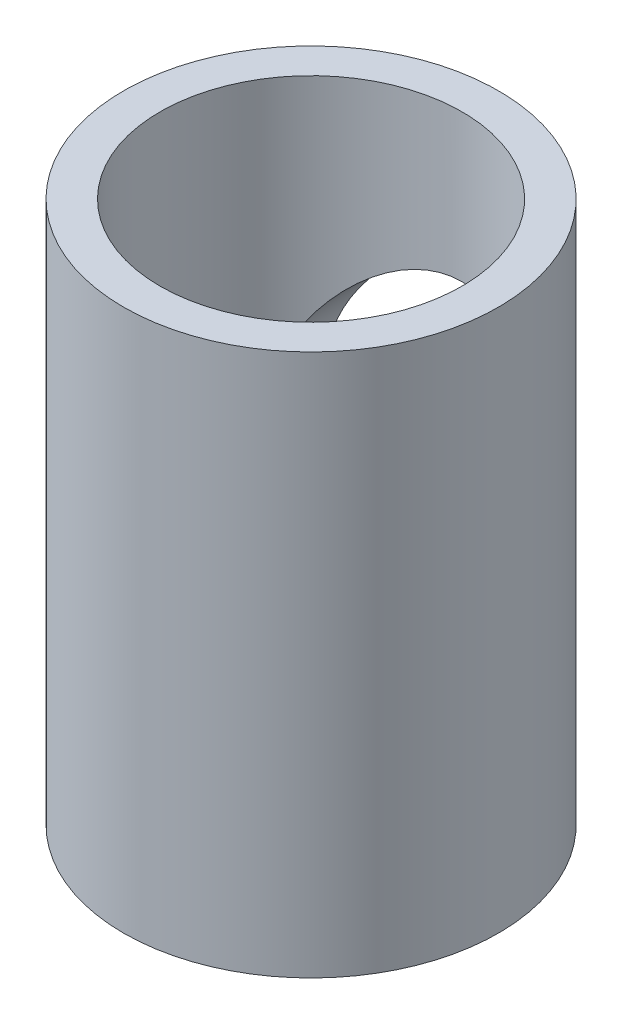
ISO-10303-21;
HEADER;
FILE_DESCRIPTION(('STEP AP214'),'2;1');
FILE_NAME('part.step','',(''),(''),'','','');
FILE_SCHEMA(('AUTOMOTIVE_DESIGN { 1 0 10303 214 1 1 1 1 }'));
ENDSEC;
DATA;
#1=APPLICATION_CONTEXT('core data for automotive mechanical design processes');
#2=APPLICATION_PROTOCOL_DEFINITION('international standard','automotive_design',2000,#1);
#3=PRODUCT_CONTEXT('',#1,'mechanical');
#4=PRODUCT('Part','Part','',(#3));
#5=PRODUCT_RELATED_PRODUCT_CATEGORY('part','',(#4));
#6=PRODUCT_DEFINITION_FORMATION('','',#4);
#7=PRODUCT_DEFINITION_CONTEXT('part definition',#1,'design');
#8=PRODUCT_DEFINITION('design','',#6,#7);
#9=PRODUCT_DEFINITION_SHAPE('','',#8);
#10=(LENGTH_UNIT() NAMED_UNIT(*) SI_UNIT(.MILLI.,.METRE.));
#11=(NAMED_UNIT(*) PLANE_ANGLE_UNIT() SI_UNIT($,.RADIAN.));
#12=(NAMED_UNIT(*) SI_UNIT($,.STERADIAN.) SOLID_ANGLE_UNIT());
#13=UNCERTAINTY_MEASURE_WITH_UNIT(LENGTH_MEASURE(1.E-05),#10,'distance_accuracy_value','');
#14=(GEOMETRIC_REPRESENTATION_CONTEXT(3) GLOBAL_UNCERTAINTY_ASSIGNED_CONTEXT((#13)) GLOBAL_UNIT_ASSIGNED_CONTEXT((#10,
#11,#12)) REPRESENTATION_CONTEXT('',''));
#15=CARTESIAN_POINT('',(0.,0.,0.));
#16=DIRECTION('',(0.,0.,1.));
#17=DIRECTION('',(1.,0.,0.));
#18=AXIS2_PLACEMENT_3D('',#15,#16,#17);
#19=CARTESIAN_POINT('',(0.,8.89,0.));
#20=DIRECTION('',(0.,1.,0.));
#21=DIRECTION('',(0.,0.,1.));
#22=AXIS2_PLACEMENT_3D('',#19,#20,#21);
#23=PLANE('',#22);
#24=CARTESIAN_POINT('',(0.,8.89,0.));
#25=DIRECTION('',(0.,1.,0.));
#26=DIRECTION('',(0.,0.,1.));
#27=AXIS2_PLACEMENT_3D('',#24,#25,#26);
#28=CIRCLE('',#27,3.0734);
#29=CARTESIAN_POINT('',(0.,8.89,3.0734));
#30=VERTEX_POINT('',#29);
#31=EDGE_CURVE('E10',#30,#30,#28,.T.);
#32=ORIENTED_EDGE('',*,*,#31,.T.);
#33=EDGE_LOOP('',(#32));
#34=FACE_BOUND('',#33,.T.);
#35=CARTESIAN_POINT('',(0.,8.89,0.));
#36=DIRECTION('',(0.,1.,0.));
#37=DIRECTION('',(0.,0.,1.));
#38=AXIS2_PLACEMENT_3D('',#35,#36,#37);
#39=CIRCLE('',#38,2.4765);
#40=CARTESIAN_POINT('',(0.,8.89,2.4765));
#41=VERTEX_POINT('',#40);
#42=EDGE_CURVE('E58',#41,#41,#39,.T.);
#43=ORIENTED_EDGE('',*,*,#42,.F.);
#44=EDGE_LOOP('',(#43));
#45=FACE_BOUND('',#44,.T.);
#46=ADVANCED_FACE('F37',(#34,#45),#23,.T.);
#47=CARTESIAN_POINT('',(0.,0.,0.));
#48=DIRECTION('',(0.,1.,0.));
#49=DIRECTION('',(0.,0.,1.));
#50=AXIS2_PLACEMENT_3D('',#47,#48,#49);
#51=PLANE('',#50);
#52=CARTESIAN_POINT('',(0.,0.,0.));
#53=DIRECTION('',(0.,1.,0.));
#54=DIRECTION('',(0.,0.,1.));
#55=AXIS2_PLACEMENT_3D('',#52,#53,#54);
#56=CIRCLE('',#55,3.0734);
#57=CARTESIAN_POINT('',(0.,0.,3.0734));
#58=VERTEX_POINT('',#57);
#59=EDGE_CURVE('E52',#58,#58,#56,.T.);
#60=ORIENTED_EDGE('',*,*,#59,.F.);
#61=EDGE_LOOP('',(#60));
#62=FACE_BOUND('',#61,.T.);
#63=CARTESIAN_POINT('',(0.,0.,0.));
#64=DIRECTION('',(0.,1.,0.));
#65=DIRECTION('',(0.,0.,1.));
#66=AXIS2_PLACEMENT_3D('',#63,#64,#65);
#67=CIRCLE('',#66,2.4765);
#68=CARTESIAN_POINT('',(0.,0.,2.4765));
#69=VERTEX_POINT('',#68);
#70=EDGE_CURVE('E60',#69,#69,#67,.T.);
#71=ORIENTED_EDGE('',*,*,#70,.T.);
#72=EDGE_LOOP('',(#71));
#73=FACE_BOUND('',#72,.T.);
#74=ADVANCED_FACE('F84',(#62,#73),#51,.F.);
#75=CARTESIAN_POINT('',(0.,8.89,0.));
#76=DIRECTION('',(0.,-1.,0.));
#77=DIRECTION('',(0.,0.,-1.));
#78=AXIS2_PLACEMENT_3D('',#75,#76,#77);
#79=CYLINDRICAL_SURFACE('',#78,3.0734);
#80=CARTESIAN_POINT('',(0.,6.477,-3.0734));
#81=CARTESIAN_POINT('',(-0.10225289942617,6.47699877673899,-3.0733987588104));
#82=CARTESIAN_POINT('',(-0.204518236075201,6.46923858992135,-3.06825192706615));
#83=CARTESIAN_POINT('',(-0.405797939531909,6.4386725816748,-3.04817386157803));
#84=CARTESIAN_POINT('',(-0.504810350964647,6.41585787842283,-3.03323685188629));
#85=CARTESIAN_POINT('',(-0.696373019028094,6.35657108321296,-2.99505551441883));
#86=CARTESIAN_POINT('',(-0.788951220287525,6.32016308280394,-2.97185019429626));
#87=CARTESIAN_POINT('',(-0.966319884194982,6.23523175988476,-2.91900488736583));
#88=CARTESIAN_POINT('',(-1.05110930544454,6.18670682049561,-2.88936404187325));
#89=CARTESIAN_POINT('',(-1.21855629463535,6.07446231452068,-2.82306285490962));
#90=CARTESIAN_POINT('',(-1.30043265214491,6.00980713574707,-2.78602154293958));
#91=CARTESIAN_POINT('',(-1.45292180382382,5.86936252834189,-2.70963033193267));
#92=CARTESIAN_POINT('',(-1.52351832435655,5.79355731060153,-2.67027720749387));
#93=CARTESIAN_POINT('',(-1.66260977928514,5.61932683734656,-2.58632522321169));
#94=CARTESIAN_POINT('',(-1.7290887644763,5.51921648518952,-2.5418570302728));
#95=CARTESIAN_POINT('',(-1.84418117486143,5.3067169126017,-2.45963196308266));
#96=CARTESIAN_POINT('',(-1.89282550432759,5.1943493744375,-2.42186353852985));
#97=CARTESIAN_POINT('',(-1.95875596980392,4.99282426563274,-2.36861226015837));
#98=CARTESIAN_POINT('',(-1.98102759644081,4.90617375705891,-2.34984585513984));
#99=CARTESIAN_POINT('',(-2.0140185642247,4.7292806421597,-2.32163746067706));
#100=CARTESIAN_POINT('',(-2.02475732038086,4.63904433881782,-2.31217980267335));
#101=CARTESIAN_POINT('',(-2.0340116458957,4.45708805476412,-2.30404644593821));
#102=CARTESIAN_POINT('',(-2.03247999464929,4.36536369928352,-2.30541239984204));
#103=CARTESIAN_POINT('',(-2.01719383795085,4.18369954603422,-2.31879478320079));
#104=CARTESIAN_POINT('',(-2.00342900083529,4.09376132241583,-2.3308202152057));
#105=CARTESIAN_POINT('',(-1.96536816682816,3.92173464510073,-2.36298439110077));
#106=CARTESIAN_POINT('',(-1.9415264028326,3.83947556513053,-2.38277080773298));
#107=CARTESIAN_POINT('',(-1.88442181144922,3.68004412907284,-2.42818237450375));
#108=CARTESIAN_POINT('',(-1.85115589104458,3.60287345327194,-2.45380944100819));
#109=CARTESIAN_POINT('',(-1.76847363686258,3.43924638979723,-2.51424020045157));
#110=CARTESIAN_POINT('',(-1.71715356744106,3.35405301819891,-2.54985242566109));
#111=CARTESIAN_POINT('',(-1.60313897441854,3.19249792881881,-2.62303919323327));
#112=CARTESIAN_POINT('',(-1.54043049773575,3.11614723513039,-2.66061610205888));
#113=CARTESIAN_POINT('',(-1.39014426962385,2.95813786254016,-2.74263664633532));
#114=CARTESIAN_POINT('',(-1.3001071845104,2.87868809219246,-2.78687960691633));
#115=CARTESIAN_POINT('',(-1.10570353883657,2.73592325309743,-2.86955257749036));
#116=CARTESIAN_POINT('',(-1.00135101158201,2.67259255445939,-2.90798820376402));
#117=CARTESIAN_POINT('',(-0.802165303404652,2.57542845795318,-2.96831941827293));
#118=CARTESIAN_POINT('',(-0.709504957816962,2.53824213346071,-2.99198167182423));
#119=CARTESIAN_POINT('',(-0.51813415434768,2.47761302617988,-3.03097877065912));
#120=CARTESIAN_POINT('',(-0.4194288455978,2.45415872140387,-3.04632059648141));
#121=CARTESIAN_POINT('',(-0.218168492122792,2.4221689249972,-3.06732152475292));
#122=CARTESIAN_POINT('',(-0.115599379268461,2.41369471387031,-3.07294085246829));
#123=CARTESIAN_POINT('',(0.0896873016520361,2.41238789467621,-3.07380453063008));
#124=CARTESIAN_POINT('',(0.192404863734689,2.41955467282581,-3.06904928819504));
#125=CARTESIAN_POINT('',(0.387876226042322,2.44808107634165,-3.05030257094717));
#126=CARTESIAN_POINT('',(0.480838119584853,2.46846414518199,-3.0369470113744));
#127=CARTESIAN_POINT('',(0.661725861047208,2.52145334897767,-3.00272994958632));
#128=CARTESIAN_POINT('',(0.749650898422593,2.55406144488304,-2.98186724321206));
#129=CARTESIAN_POINT('',(0.924226037110275,2.63266059760848,-2.93263342064935));
#130=CARTESIAN_POINT('',(1.01043795708874,2.6793719799755,-2.90386859721382));
#131=CARTESIAN_POINT('',(1.17411688551911,2.78370284484504,-2.84164011803446));
#132=CARTESIAN_POINT('',(1.25157813514077,2.84132944467493,-2.8081734000925));
#133=CARTESIAN_POINT('',(1.408430799629,2.97610195690367,-2.73327598988553));
#134=CARTESIAN_POINT('',(1.48620730110174,3.05489250165295,-2.69142085646646));
#135=CARTESIAN_POINT('',(1.62812494509582,3.22416309652032,-2.60802108601504));
#136=CARTESIAN_POINT('',(1.69225791404109,3.31465010187625,-2.56647664941222));
#137=CARTESIAN_POINT('',(1.80015167325279,3.49706016572785,-2.49181059031919));
#138=CARTESIAN_POINT('',(1.84528515090161,3.58799250333235,-2.45826284586167));
#139=CARTESIAN_POINT('',(1.92201406567958,3.77768707368384,-2.3987534014274));
#140=CARTESIAN_POINT('',(1.95363394272279,3.87643478521648,-2.37277803377778));
#141=CARTESIAN_POINT('',(1.99757490308141,4.06258585187896,-2.33584425333396));
#142=CARTESIAN_POINT('',(2.01226302098541,4.1490637980316,-2.32308360719194));
#143=CARTESIAN_POINT('',(2.0302977893316,4.32404517518141,-2.30734318883211));
#144=CARTESIAN_POINT('',(2.03365556408794,4.41254653353513,-2.30435382310355));
#145=CARTESIAN_POINT('',(2.02881383253913,4.58898105212255,-2.30861622238297));
#146=CARTESIAN_POINT('',(2.02061283367468,4.67691413750338,-2.31586930997692));
#147=CARTESIAN_POINT('',(1.99319658113794,4.84981974407824,-2.33950223156355));
#148=CARTESIAN_POINT('',(1.97396675832368,4.93478819115338,-2.35589413718817));
#149=CARTESIAN_POINT('',(1.91875298710554,5.12285717986865,-2.40120087202976));
#150=CARTESIAN_POINT('',(1.87960955273754,5.22448869378104,-2.43232347057093));
#151=CARTESIAN_POINT('',(1.78689301524272,5.41846738756082,-2.50122587404046));
#152=CARTESIAN_POINT('',(1.73329982784391,5.51080139725334,-2.53901491945611));
#153=CARTESIAN_POINT('',(1.61198706223949,5.68682828690856,-2.61774835566215));
#154=CARTESIAN_POINT('',(1.54403830758173,5.77034323971913,-2.65873614885324));
#155=CARTESIAN_POINT('',(1.39550617835717,5.92593084090089,-2.73961808722974));
#156=CARTESIAN_POINT('',(1.3149191302179,5.99800015006984,-2.7795119104574));
#157=CARTESIAN_POINT('',(1.13076518652201,6.137753791451,-2.85980762818421));
#158=CARTESIAN_POINT('',(1.02557491285099,6.20367287402469,-2.89961107058536));
#159=CARTESIAN_POINT('',(0.802280508517006,6.31607103199848,-2.96912772684367));
#160=CARTESIAN_POINT('',(0.684200318744576,6.36258539870891,-2.99885923981275));
#161=CARTESIAN_POINT('',(0.471377740531871,6.42380422839951,-3.03842882477958));
#162=CARTESIAN_POINT('',(0.378690310217695,6.4436621084466,-3.05144513212511));
#163=CARTESIAN_POINT('',(0.190671163164194,6.47025681845768,-3.06892885767475));
#164=CARTESIAN_POINT('',(0.0953409878984267,6.47700114057317,-3.07340115728985));
#165=CARTESIAN_POINT('',(0.,6.477,-3.0734));
#166=B_SPLINE_CURVE_WITH_KNOTS('',3,(#80,#81,#82,#83,#84,#85,#86,#87,#88,#89,#90,#91,#92,#93,
#94,#95,#96,#97,#98,#99,#100,#101,#102,#103,#104,#105,#106,#107,#108,#109,#110,#111,#112,#113,
#114,#115,#116,#117,#118,#119,#120,#121,#122,#123,#124,#125,#126,#127,#128,#129,#130,#131,#132,
#133,#134,#135,#136,#137,#138,#139,#140,#141,#142,#143,#144,#145,#146,#147,#148,#149,#150,#151,
#152,#153,#154,#155,#156,#157,#158,#159,#160,#161,#162,#163,#164,#165),.UNSPECIFIED.,.T.,.F.,(4,
2,2,2,2,2,2,2,2,2,2,2,2,2,2,2,2,2,2,2,2,2,2,2,2,2,2,2,2,2,2,2,2,2,2,2,2,2,2,2,2,2,4),(0.,
0.306373505804366,0.6129279268288,0.918054850064876,1.22322251108127,1.55409610838465,
1.88544283513527,2.2680670471764,2.650025070639,2.92317324477001,3.19586086335182,
3.46959837714451,3.74356729871388,4.00631955200361,4.26915814092834,4.58496815012121,
4.90116773278214,5.28325304326235,5.66496644023595,5.97150248526908,6.27778095821417,
6.58530947940367,6.89282593278601,7.17987144943446,7.46696302920455,7.77234683746643,
8.07793046271756,8.43160801754241,8.78549686076078,9.10505789912865,9.42403852681178,
9.68879042887973,9.95328231749755,10.217808362507,10.4826846555157,10.8206753611555,
11.159138296867,11.5034795338635,11.8479210466649,12.2367997450483,12.6249680744557,
12.9107952325268,13.1964590413108),.UNSPECIFIED.);
#167=CARTESIAN_POINT('',(0.,6.477,-3.0734));
#168=VERTEX_POINT('',#167);
#169=EDGE_CURVE('E64',#168,#168,#166,.T.);
#170=ORIENTED_EDGE('',*,*,#169,.T.);
#171=EDGE_LOOP('',(#170));
#172=FACE_BOUND('',#171,.T.);
#173=ORIENTED_EDGE('',*,*,#31,.F.);
#174=EDGE_LOOP('',(#173));
#175=FACE_BOUND('',#174,.T.);
#176=ORIENTED_EDGE('',*,*,#59,.T.);
#177=EDGE_LOOP('',(#176));
#178=FACE_BOUND('',#177,.T.);
#179=ADVANCED_FACE('F39',(#172,#175,#178),#79,.T.);
#180=CARTESIAN_POINT('',(0.,8.89,0.));
#181=DIRECTION('',(0.,-1.,0.));
#182=DIRECTION('',(0.,0.,-1.));
#183=AXIS2_PLACEMENT_3D('',#180,#181,#182);
#184=CYLINDRICAL_SURFACE('',#183,2.4765);
#185=CARTESIAN_POINT('',(0.,6.477,-2.4765));
#186=CARTESIAN_POINT('',(-0.0968633235630444,6.47699164919354,-2.47649186598758));
#187=CARTESIAN_POINT('',(-0.193842807933544,6.47001673117817,-2.47076019933378));
#188=CARTESIAN_POINT('',(-0.384648142920058,6.44259987522917,-2.44834107786058));
#189=CARTESIAN_POINT('',(-0.478467797148274,6.42213293143819,-2.43163328029215));
#190=CARTESIAN_POINT('',(-0.659678395164487,6.36924112939771,-2.38882650661548));
#191=CARTESIAN_POINT('',(-0.747106061122676,6.33689229030201,-2.3627872574241));
#192=CARTESIAN_POINT('',(-0.914549749987563,6.26188054834556,-2.3031648394329));
#193=CARTESIAN_POINT('',(-0.994565016895317,6.21921659503307,-2.26958090233564));
#194=CARTESIAN_POINT('',(-1.17380245827522,6.10812481840184,-2.1836542024751));
#195=CARTESIAN_POINT('',(-1.26955644128869,6.03595289202546,-2.12891253598948));
#196=CARTESIAN_POINT('',(-1.44542428948267,5.87811324177596,-2.0136819285567));
#197=CARTESIAN_POINT('',(-1.5254921760427,5.79240713485001,-1.95317684225961));
#198=CARTESIAN_POINT('',(-1.67098788361007,5.60729718639532,-1.83030366278542));
#199=CARTESIAN_POINT('',(-1.73613614391906,5.50768059483014,-1.76792147997888));
#200=CARTESIAN_POINT('',(-1.82084368205338,5.34894978733039,-1.67906893113639));
#201=CARTESIAN_POINT('',(-1.84689462075652,5.29453611620304,-1.65025952155744));
#202=CARTESIAN_POINT('',(-1.89444551737781,5.18243268321279,-1.59544271208416));
#203=CARTESIAN_POINT('',(-1.91594939176735,5.12474579540707,-1.56943291039523));
#204=CARTESIAN_POINT('',(-1.95621320570297,4.99915184711546,-1.51902598391126));
#205=CARTESIAN_POINT('',(-1.97437486769127,4.93083171877489,-1.49515665365234));
#206=CARTESIAN_POINT('',(-2.00369145249695,4.79048317138705,-1.4556393929088));
#207=CARTESIAN_POINT('',(-2.01486382445067,4.71846447689008,-1.43997100445462));
#208=CARTESIAN_POINT('',(-2.02943358164799,4.57122874388721,-1.41937645136508));
#209=CARTESIAN_POINT('',(-2.03274612973573,4.49598565306188,-1.41456752785387));
#210=CARTESIAN_POINT('',(-2.03096780849949,4.34579574458313,-1.41711713420056));
#211=CARTESIAN_POINT('',(-2.02587343645277,4.27084906347082,-1.42448073571343));
#212=CARTESIAN_POINT('',(-2.00679306364782,4.1153919057665,-1.45124694566484));
#213=CARTESIAN_POINT('',(-1.99185103324708,4.03523407225118,-1.47193781599021));
#214=CARTESIAN_POINT('',(-1.95349260242072,3.8799019270371,-1.52246905401837));
#215=CARTESIAN_POINT('',(-1.93004932254668,3.80474432732575,-1.55233839619248));
#216=CARTESIAN_POINT('',(-1.8818091577629,3.67595422911355,-1.61026027983061));
#217=CARTESIAN_POINT('',(-1.85847997271246,3.62125918094276,-1.63723256116843));
#218=CARTESIAN_POINT('',(-1.80761846884718,3.51493974220904,-1.6932225467792));
#219=CARTESIAN_POINT('',(-1.78008389169892,3.4633170223374,-1.72224134551664));
#220=CARTESIAN_POINT('',(-1.69138040458051,3.31281145426799,-1.81086809041039));
#221=CARTESIAN_POINT('',(-1.62413210666212,3.21834437751427,-1.87202030889349));
#222=CARTESIAN_POINT('',(-1.47089856893306,3.03785550489779,-1.99489236171898));
#223=CARTESIAN_POINT('',(-1.38426108910332,2.95233518521206,-2.0565336527821));
#224=CARTESIAN_POINT('',(-1.19418107020911,2.79637011718851,-2.17239591532494));
#225=CARTESIAN_POINT('',(-1.09078006318465,2.7258890834934,-2.22663463031068));
#226=CARTESIAN_POINT('',(-0.898060774508087,2.61985338376777,-2.30963706910333));
#227=CARTESIAN_POINT('',(-0.812372981555133,2.57999918049392,-2.34133435169939));
#228=CARTESIAN_POINT('',(-0.633777229826164,2.51200850833113,-2.39584398568385));
#229=CARTESIAN_POINT('',(-0.540874397700057,2.4838638080272,-2.41866257778111));
#230=CARTESIAN_POINT('',(-0.349388159429486,2.44084567762372,-2.45367175500657));
#231=CARTESIAN_POINT('',(-0.250771504900729,2.4260604624716,-2.46579168310635));
#232=CARTESIAN_POINT('',(-0.0517003972668234,2.41121122661114,-2.47796395042645));
#233=CARTESIAN_POINT('',(0.0487532371903013,2.41114080081449,-2.47802154016996));
#234=CARTESIAN_POINT('',(0.237480104421087,2.42493899229513,-2.46671112799628));
#235=CARTESIAN_POINT('',(0.325937565426901,2.43736509312792,-2.45652553323957));
#236=CARTESIAN_POINT('',(0.499041133329243,2.47324975989327,-2.42728641524342));
#237=CARTESIAN_POINT('',(0.58368655754803,2.49671029338356,-2.40823131048147));
#238=CARTESIAN_POINT('',(0.750229404440987,2.55443914357586,-2.36176725012501));
#239=CARTESIAN_POINT('',(0.831931101294343,2.58905258732924,-2.33409262726847));
#240=CARTESIAN_POINT('',(0.988209037615537,2.66732857169314,-2.27234839404361));
#241=CARTESIAN_POINT('',(1.06278316431844,2.71099378336241,-2.2382768963214));
#242=CARTESIAN_POINT('',(1.236270371585,2.82759771935565,-2.1489602649574));
#243=CARTESIAN_POINT('',(1.33094852337859,2.90484701264892,-2.0911056679274));
#244=CARTESIAN_POINT('',(1.50394164726101,3.07319586967983,-1.97037273303755));
#245=CARTESIAN_POINT('',(1.58219184251791,3.16434790285386,-1.90747581085933));
#246=CARTESIAN_POINT('',(1.68742971206999,3.31128675046197,-1.8132603258129));
#247=CARTESIAN_POINT('',(1.72071914744717,3.36245545363307,-1.78160417291524));
#248=CARTESIAN_POINT('',(1.78284934946326,3.46815051119463,-1.71942664499806));
#249=CARTESIAN_POINT('',(1.8116880389218,3.52267841682752,-1.68890580484632));
#250=CARTESIAN_POINT('',(1.86457622952763,3.63493100792793,-1.63032453649908));
#251=CARTESIAN_POINT('',(1.88864612890932,3.69264066578881,-1.60225392938525));
#252=CARTESIAN_POINT('',(1.93176989483628,3.81153199437545,-1.54998819544754));
#253=CARTESIAN_POINT('',(1.95083013082213,3.87270913488102,-1.52578816294019));
#254=CARTESIAN_POINT('',(1.98409631954637,4.00119209003197,-1.48229501402345));
#255=CARTESIAN_POINT('',(1.99806521474432,4.06864732403901,-1.46325019899147));
#256=CARTESIAN_POINT('',(2.0191405629939,4.20641053084565,-1.43403588995012));
#257=CARTESIAN_POINT('',(2.02626452765176,4.27671074193276,-1.42384375430183));
#258=CARTESIAN_POINT('',(2.03308452493742,4.41891502803209,-1.41409464886377));
#259=CARTESIAN_POINT('',(2.03273208984132,4.49082654742522,-1.41460707387176));
#260=CARTESIAN_POINT('',(2.02451402245386,4.63337429838805,-1.42633695158401));
#261=CARTESIAN_POINT('',(2.01663703982085,4.70400843907241,-1.43757057657052));
#262=CARTESIAN_POINT('',(1.99109538222948,4.86016999063014,-1.47280897562386));
#263=CARTESIAN_POINT('',(1.97140972548426,4.94476130203705,-1.49938540229956));
#264=CARTESIAN_POINT('',(1.92272872516688,5.10790029347324,-1.56131625792564));
#265=CARTESIAN_POINT('',(1.89370420180613,5.18642806118766,-1.59669812037864));
#266=CARTESIAN_POINT('',(1.8352697441347,5.31950394226456,-1.66322476807985));
#267=CARTESIAN_POINT('',(1.80757958354759,5.37532613615986,-1.69338801359815));
#268=CARTESIAN_POINT('',(1.74761139788915,5.48361090955238,-1.75520968550699));
#269=CARTESIAN_POINT('',(1.7153311865828,5.53607187072675,-1.78686881956153));
#270=CARTESIAN_POINT('',(1.64628126007511,5.63770958897917,-1.85068128437817));
#271=CARTESIAN_POINT('',(1.60950813415888,5.6868838066255,-1.88283497418463));
#272=CARTESIAN_POINT('',(1.53154526415909,5.78185223163557,-1.94678544570301));
#273=CARTESIAN_POINT('',(1.49035323767106,5.82764467146186,-1.97858203351111));
#274=CARTESIAN_POINT('',(1.35830827332349,5.96155280441986,-2.07362552398582));
#275=CARTESIAN_POINT('',(1.26034101864195,6.04418535958712,-2.13520908270549));
#276=CARTESIAN_POINT('',(1.10023026298486,6.15459387742566,-2.2195037159262));
#277=CARTESIAN_POINT('',(1.04471053470903,6.1891203851674,-2.24623910971759));
#278=CARTESIAN_POINT('',(0.929437461393536,6.25317967155478,-2.29633160501585));
#279=CARTESIAN_POINT('',(0.869686576815116,6.28271531914231,-2.31969064625787));
#280=CARTESIAN_POINT('',(0.725034936464516,6.34539800171599,-2.36961346038991));
#281=CARTESIAN_POINT('',(0.638554149691546,6.37629133996775,-2.39451476507027));
#282=CARTESIAN_POINT('',(0.460310904215282,6.42632821327415,-2.43505092776776));
#283=CARTESIAN_POINT('',(0.368561722146875,6.44549997857111,-2.4507080463381));
#284=CARTESIAN_POINT('',(0.229986945566821,6.4644663996758,-2.46622430305885));
#285=CARTESIAN_POINT('',(0.184213920181521,6.46915636214552,-2.47006757813437));
#286=CARTESIAN_POINT('',(0.092302785657809,6.47542555370226,-2.47520769351952));
#287=CARTESIAN_POINT('',(0.0461645853796213,6.47700397995344,-2.47650387663046));
#288=CARTESIAN_POINT('',(0.,6.477,-2.4765));
#289=B_SPLINE_CURVE_WITH_KNOTS('',3,(#185,#186,#187,#188,#189,#190,#191,#192,#193,#194,#195,
#196,#197,#198,#199,#200,#201,#202,#203,#204,#205,#206,#207,#208,#209,#210,#211,#212,#213,#214,
#215,#216,#217,#218,#219,#220,#221,#222,#223,#224,#225,#226,#227,#228,#229,#230,#231,#232,#233,
#234,#235,#236,#237,#238,#239,#240,#241,#242,#243,#244,#245,#246,#247,#248,#249,#250,#251,#252,
#253,#254,#255,#256,#257,#258,#259,#260,#261,#262,#263,#264,#265,#266,#267,#268,#269,#270,#271,
#272,#273,#274,#275,#276,#277,#278,#279,#280,#281,#282,#283,#284,#285,#286,#287,#288),
.UNSPECIFIED.,.T.,.F.,(4,2,2,2,2,2,2,2,2,2,2,2,2,2,2,2,2,2,2,2,2,2,2,2,2,2,2,2,2,2,2,2,2,2,2,2,
2,2,2,2,2,2,2,2,2,2,2,2,2,2,2,4),(0.,0.290389842230658,0.581319406224711,0.870419163407019,
1.15954837381152,1.55285964438895,1.9473070728594,2.34863106276753,2.54897044396008,
2.74913655982179,2.97227844698859,3.19486100171776,3.4198353453266,3.64490344761385,
3.89587961388736,4.14765634200306,4.34328611202249,4.53902130878469,4.93067746669053,
5.33830483113001,5.74493730345856,6.04280910565807,6.34047115802755,6.64008465681724,
6.93956773886293,7.20804184949515,7.47656385010111,7.75435519100105,8.03222862149084,
8.43570305858277,8.84073972860928,9.04684797367963,9.25305212126128,9.45835423813842,
9.66339405086169,9.87703141071393,10.0901207483734,10.304591913285,10.519387107164,
10.7903567787381,11.0621814681315,11.2696192168059,11.4771561008307,11.6848515232054,
11.8926547435303,12.3164563227604,12.5280584954232,12.7395386139942,13.023779075724,
13.3073322478637,13.4456949282134,13.5840933041096),.UNSPECIFIED.);
#290=CARTESIAN_POINT('',(0.,6.477,-2.4765));
#291=VERTEX_POINT('',#290);
#292=EDGE_CURVE('E42',#291,#291,#289,.T.);
#293=ORIENTED_EDGE('',*,*,#292,.F.);
#294=EDGE_LOOP('',(#293));
#295=FACE_BOUND('',#294,.T.);
#296=ORIENTED_EDGE('',*,*,#42,.T.);
#297=EDGE_LOOP('',(#296));
#298=FACE_BOUND('',#297,.T.);
#299=ORIENTED_EDGE('',*,*,#70,.F.);
#300=EDGE_LOOP('',(#299));
#301=FACE_BOUND('',#300,.T.);
#302=ADVANCED_FACE('F76',(#295,#298,#301),#184,.F.);
#303=CARTESIAN_POINT('',(0.,4.445,-8.89));
#304=DIRECTION('',(0.,0.,1.));
#305=DIRECTION('',(1.,0.,0.));
#306=AXIS2_PLACEMENT_3D('',#303,#304,#305);
#307=CYLINDRICAL_SURFACE('',#306,2.032);
#308=ORIENTED_EDGE('',*,*,#292,.T.);
#309=EDGE_LOOP('',(#308));
#310=FACE_BOUND('',#309,.T.);
#311=ORIENTED_EDGE('',*,*,#169,.F.);
#312=EDGE_LOOP('',(#311));
#313=FACE_BOUND('',#312,.T.);
#314=ADVANCED_FACE('F73',(#310,#313),#307,.F.);
#315=CLOSED_SHELL('',(#46,#74,#179,#302,#314));
#316=MANIFOLD_SOLID_BREP('B2',#315);
#317=ADVANCED_BREP_SHAPE_REPRESENTATION('',(#18,#316),#14);
#318=SHAPE_DEFINITION_REPRESENTATION(#9,#317);
ENDSEC;
END-ISO-10303-21;
